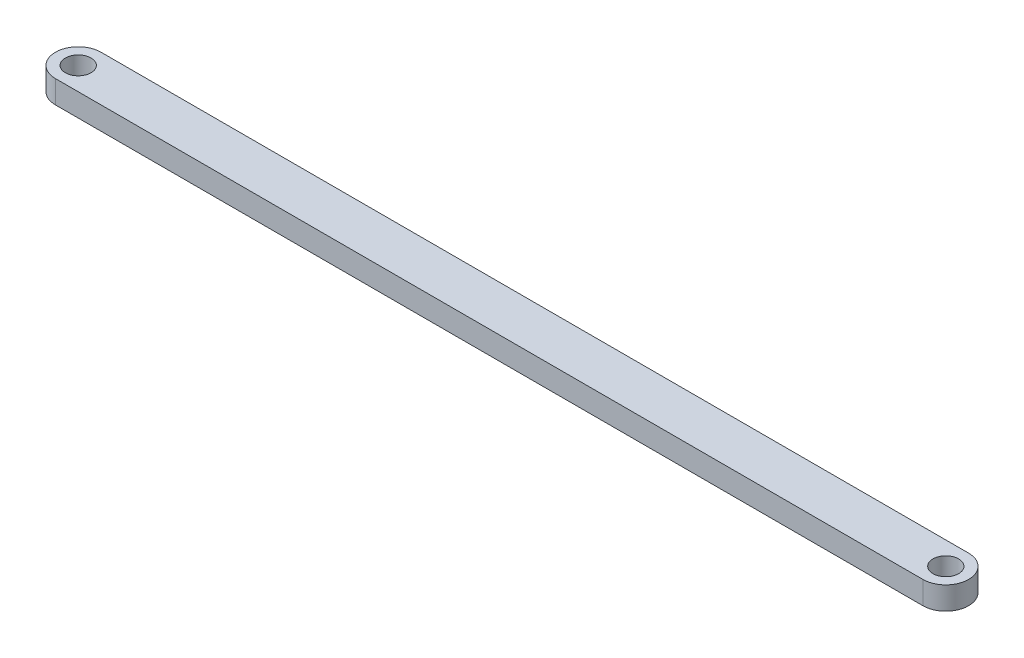
ISO-10303-21;
HEADER;
FILE_DESCRIPTION(('STEP AP214'),'2;1');
FILE_NAME('part.step','',(''),(''),'','','');
FILE_SCHEMA(('AUTOMOTIVE_DESIGN { 1 0 10303 214 1 1 1 1 }'));
ENDSEC;
DATA;
#1=APPLICATION_CONTEXT('core data for automotive mechanical design processes');
#2=APPLICATION_PROTOCOL_DEFINITION('international standard','automotive_design',2000,#1);
#3=PRODUCT_CONTEXT('',#1,'mechanical');
#4=PRODUCT('Part','Part','',(#3));
#5=PRODUCT_RELATED_PRODUCT_CATEGORY('part','',(#4));
#6=PRODUCT_DEFINITION_FORMATION('','',#4);
#7=PRODUCT_DEFINITION_CONTEXT('part definition',#1,'design');
#8=PRODUCT_DEFINITION('design','',#6,#7);
#9=PRODUCT_DEFINITION_SHAPE('','',#8);
#10=(LENGTH_UNIT() NAMED_UNIT(*) SI_UNIT(.MILLI.,.METRE.));
#11=(NAMED_UNIT(*) PLANE_ANGLE_UNIT() SI_UNIT($,.RADIAN.));
#12=(NAMED_UNIT(*) SI_UNIT($,.STERADIAN.) SOLID_ANGLE_UNIT());
#13=UNCERTAINTY_MEASURE_WITH_UNIT(LENGTH_MEASURE(1.E-05),#10,'distance_accuracy_value','');
#14=(GEOMETRIC_REPRESENTATION_CONTEXT(3) GLOBAL_UNCERTAINTY_ASSIGNED_CONTEXT((#13)) GLOBAL_UNIT_ASSIGNED_CONTEXT((#10,
#11,#12)) REPRESENTATION_CONTEXT('',''));
#15=CARTESIAN_POINT('',(0.,0.,0.));
#16=DIRECTION('',(0.,0.,1.));
#17=DIRECTION('',(1.,0.,0.));
#18=AXIS2_PLACEMENT_3D('',#15,#16,#17);
#19=CARTESIAN_POINT('',(60.366783,3.175,0.));
#20=DIRECTION('',(0.,-1.,0.));
#21=DIRECTION('',(0.,0.,-1.));
#22=AXIS2_PLACEMENT_3D('',#19,#20,#21);
#23=CYLINDRICAL_SURFACE('',#22,3.17499999999998);
#24=CARTESIAN_POINT('',(60.366783,0.,0.));
#25=DIRECTION('',(0.,1.,0.));
#26=DIRECTION('',(0.,0.,1.));
#27=AXIS2_PLACEMENT_3D('',#24,#25,#26);
#28=CIRCLE('',#27,3.17499999999998);
#29=CARTESIAN_POINT('',(60.366783,0.,3.17499999999995));
#30=VERTEX_POINT('',#29);
#31=CARTESIAN_POINT('',(60.366783,0.,-3.175));
#32=VERTEX_POINT('',#31);
#33=EDGE_CURVE('E96',#30,#32,#28,.T.);
#34=ORIENTED_EDGE('',*,*,#33,.T.);
#35=DIRECTION('',(0.,-1.,0.));
#36=VECTOR('',#35,1.);
#37=CARTESIAN_POINT('',(60.366783,3.175,-3.175));
#38=LINE('',#37,#36);
#39=CARTESIAN_POINT('',(60.366783,3.175,-3.175));
#40=VERTEX_POINT('',#39);
#41=EDGE_CURVE('E11',#40,#32,#38,.T.);
#42=ORIENTED_EDGE('',*,*,#41,.F.);
#43=CARTESIAN_POINT('',(60.366783,3.175,0.));
#44=DIRECTION('',(0.,1.,0.));
#45=DIRECTION('',(0.,0.,1.));
#46=AXIS2_PLACEMENT_3D('',#43,#44,#45);
#47=CIRCLE('',#46,3.17499999999998);
#48=CARTESIAN_POINT('',(60.366783,3.175,3.17499999999995));
#49=VERTEX_POINT('',#48);
#50=EDGE_CURVE('E84',#49,#40,#47,.T.);
#51=ORIENTED_EDGE('',*,*,#50,.F.);
#52=DIRECTION('',(0.,-1.,0.));
#53=VECTOR('',#52,1.);
#54=CARTESIAN_POINT('',(60.366783,3.175,3.17499999999995));
#55=LINE('',#54,#53);
#56=EDGE_CURVE('E92',#49,#30,#55,.T.);
#57=ORIENTED_EDGE('',*,*,#56,.T.);
#58=EDGE_LOOP('',(#34,#42,#51,#57));
#59=FACE_BOUND('',#58,.T.);
#60=ADVANCED_FACE('F33',(#59),#23,.T.);
#61=CARTESIAN_POINT('',(60.366783,3.175,-3.175));
#62=DIRECTION('',(0.,0.,1.));
#63=DIRECTION('',(1.,0.,0.));
#64=AXIS2_PLACEMENT_3D('',#61,#62,#63);
#65=PLANE('',#64);
#66=DIRECTION('',(-1.,0.,0.));
#67=VECTOR('',#66,1.);
#68=CARTESIAN_POINT('',(60.366783,0.,-3.175));
#69=LINE('',#68,#67);
#70=CARTESIAN_POINT('',(-60.366783,0.,-3.17499999999998));
#71=VERTEX_POINT('',#70);
#72=EDGE_CURVE('E88',#32,#71,#69,.T.);
#73=ORIENTED_EDGE('',*,*,#72,.T.);
#74=DIRECTION('',(0.,-1.,0.));
#75=VECTOR('',#74,1.);
#76=CARTESIAN_POINT('',(-60.366783,3.175,-3.17499999999998));
#77=LINE('',#76,#75);
#78=CARTESIAN_POINT('',(-60.366783,3.175,-3.17499999999998));
#79=VERTEX_POINT('',#78);
#80=EDGE_CURVE('E41',#79,#71,#77,.T.);
#81=ORIENTED_EDGE('',*,*,#80,.F.);
#82=DIRECTION('',(-1.,0.,0.));
#83=VECTOR('',#82,1.);
#84=CARTESIAN_POINT('',(60.366783,3.175,-3.175));
#85=LINE('',#84,#83);
#86=EDGE_CURVE('E79',#40,#79,#85,.T.);
#87=ORIENTED_EDGE('',*,*,#86,.F.);
#88=ORIENTED_EDGE('',*,*,#41,.T.);
#89=EDGE_LOOP('',(#73,#81,#87,#88));
#90=FACE_BOUND('',#89,.T.);
#91=ADVANCED_FACE('F87',(#90),#65,.F.);
#92=CARTESIAN_POINT('',(-60.366783,3.175,0.));
#93=DIRECTION('',(0.,-1.,0.));
#94=DIRECTION('',(0.,0.,-1.));
#95=AXIS2_PLACEMENT_3D('',#92,#93,#94);
#96=CYLINDRICAL_SURFACE('',#95,3.17499999999998);
#97=CARTESIAN_POINT('',(-60.366783,0.,0.));
#98=DIRECTION('',(0.,1.,0.));
#99=DIRECTION('',(0.,0.,1.));
#100=AXIS2_PLACEMENT_3D('',#97,#98,#99);
#101=CIRCLE('',#100,3.17499999999998);
#102=CARTESIAN_POINT('',(-60.366783,0.,3.17499999999999));
#103=VERTEX_POINT('',#102);
#104=EDGE_CURVE('E66',#71,#103,#101,.T.);
#105=ORIENTED_EDGE('',*,*,#104,.T.);
#106=DIRECTION('',(0.,-1.,0.));
#107=VECTOR('',#106,1.);
#108=CARTESIAN_POINT('',(-60.366783,3.175,3.17499999999999));
#109=LINE('',#108,#107);
#110=CARTESIAN_POINT('',(-60.366783,3.175,3.17499999999999));
#111=VERTEX_POINT('',#110);
#112=EDGE_CURVE('E89',#111,#103,#109,.T.);
#113=ORIENTED_EDGE('',*,*,#112,.F.);
#114=CARTESIAN_POINT('',(-60.366783,3.175,0.));
#115=DIRECTION('',(0.,1.,0.));
#116=DIRECTION('',(0.,0.,1.));
#117=AXIS2_PLACEMENT_3D('',#114,#115,#116);
#118=CIRCLE('',#117,3.17499999999998);
#119=EDGE_CURVE('E82',#79,#111,#118,.T.);
#120=ORIENTED_EDGE('',*,*,#119,.F.);
#121=ORIENTED_EDGE('',*,*,#80,.T.);
#122=EDGE_LOOP('',(#105,#113,#120,#121));
#123=FACE_BOUND('',#122,.T.);
#124=ADVANCED_FACE('F90',(#123),#96,.T.);
#125=CARTESIAN_POINT('',(60.366783,3.175,3.17499999999995));
#126=DIRECTION('',(0.,0.,-1.));
#127=DIRECTION('',(-1.,0.,0.));
#128=AXIS2_PLACEMENT_3D('',#125,#126,#127);
#129=PLANE('',#128);
#130=DIRECTION('',(1.,0.,0.));
#131=VECTOR('',#130,1.);
#132=CARTESIAN_POINT('',(60.366783,0.,3.17499999999995));
#133=LINE('',#132,#131);
#134=EDGE_CURVE('E72',#103,#30,#133,.T.);
#135=ORIENTED_EDGE('',*,*,#134,.T.);
#136=ORIENTED_EDGE('',*,*,#56,.F.);
#137=DIRECTION('',(1.,0.,0.));
#138=VECTOR('',#137,1.);
#139=CARTESIAN_POINT('',(60.366783,3.175,3.17499999999995));
#140=LINE('',#139,#138);
#141=EDGE_CURVE('E49',#111,#49,#140,.T.);
#142=ORIENTED_EDGE('',*,*,#141,.F.);
#143=ORIENTED_EDGE('',*,*,#112,.T.);
#144=EDGE_LOOP('',(#135,#136,#142,#143));
#145=FACE_BOUND('',#144,.T.);
#146=ADVANCED_FACE('F104',(#145),#129,.F.);
#147=CARTESIAN_POINT('',(60.366783,3.175,0.));
#148=DIRECTION('',(0.,1.,0.));
#149=DIRECTION('',(0.,0.,1.));
#150=AXIS2_PLACEMENT_3D('',#147,#148,#149);
#151=PLANE('',#150);
#152=CARTESIAN_POINT('',(60.366783,3.175,0.));
#153=DIRECTION('',(0.,1.,0.));
#154=DIRECTION('',(0.,0.,1.));
#155=AXIS2_PLACEMENT_3D('',#152,#153,#154);
#156=CIRCLE('',#155,1.78600099999999);
#157=CARTESIAN_POINT('',(60.366783,3.175,1.78600099999999));
#158=VERTEX_POINT('',#157);
#159=EDGE_CURVE('E118',#158,#158,#156,.T.);
#160=ORIENTED_EDGE('',*,*,#159,.F.);
#161=EDGE_LOOP('',(#160));
#162=FACE_BOUND('',#161,.T.);
#163=CARTESIAN_POINT('',(-60.366783,3.175,0.));
#164=DIRECTION('',(0.,1.,0.));
#165=DIRECTION('',(0.,0.,1.));
#166=AXIS2_PLACEMENT_3D('',#163,#164,#165);
#167=CIRCLE('',#166,1.78600099999999);
#168=CARTESIAN_POINT('',(-60.366783,3.175,1.78600099999999));
#169=VERTEX_POINT('',#168);
#170=EDGE_CURVE('E112',#169,#169,#167,.T.);
#171=ORIENTED_EDGE('',*,*,#170,.F.);
#172=EDGE_LOOP('',(#171));
#173=FACE_BOUND('',#172,.T.);
#174=ORIENTED_EDGE('',*,*,#50,.T.);
#175=ORIENTED_EDGE('',*,*,#86,.T.);
#176=ORIENTED_EDGE('',*,*,#119,.T.);
#177=ORIENTED_EDGE('',*,*,#141,.T.);
#178=EDGE_LOOP('',(#174,#175,#176,#177));
#179=FACE_BOUND('',#178,.T.);
#180=ADVANCED_FACE('F80',(#162,#173,#179),#151,.T.);
#181=CARTESIAN_POINT('',(60.366783,0.,0.));
#182=DIRECTION('',(0.,1.,0.));
#183=DIRECTION('',(0.,0.,1.));
#184=AXIS2_PLACEMENT_3D('',#181,#182,#183);
#185=PLANE('',#184);
#186=CARTESIAN_POINT('',(60.366783,0.,0.));
#187=DIRECTION('',(0.,1.,0.));
#188=DIRECTION('',(0.,0.,1.));
#189=AXIS2_PLACEMENT_3D('',#186,#187,#188);
#190=CIRCLE('',#189,1.786001);
#191=CARTESIAN_POINT('',(60.366783,0.,1.786001));
#192=VERTEX_POINT('',#191);
#193=EDGE_CURVE('E115',#192,#192,#190,.T.);
#194=ORIENTED_EDGE('',*,*,#193,.T.);
#195=EDGE_LOOP('',(#194));
#196=FACE_BOUND('',#195,.T.);
#197=CARTESIAN_POINT('',(-60.366783,0.,0.));
#198=DIRECTION('',(0.,1.,0.));
#199=DIRECTION('',(0.,0.,1.));
#200=AXIS2_PLACEMENT_3D('',#197,#198,#199);
#201=CIRCLE('',#200,1.786001);
#202=CARTESIAN_POINT('',(-60.366783,0.,1.786001));
#203=VERTEX_POINT('',#202);
#204=EDGE_CURVE('E99',#203,#203,#201,.T.);
#205=ORIENTED_EDGE('',*,*,#204,.T.);
#206=EDGE_LOOP('',(#205));
#207=FACE_BOUND('',#206,.T.);
#208=ORIENTED_EDGE('',*,*,#33,.F.);
#209=ORIENTED_EDGE('',*,*,#134,.F.);
#210=ORIENTED_EDGE('',*,*,#104,.F.);
#211=ORIENTED_EDGE('',*,*,#72,.F.);
#212=EDGE_LOOP('',(#208,#209,#210,#211));
#213=FACE_BOUND('',#212,.T.);
#214=ADVANCED_FACE('F107',(#196,#207,#213),#185,.F.);
#215=CARTESIAN_POINT('',(-60.366783,3.175,0.));
#216=DIRECTION('',(0.,1.,0.));
#217=DIRECTION('',(0.,0.,1.));
#218=AXIS2_PLACEMENT_3D('',#215,#216,#217);
#219=CYLINDRICAL_SURFACE('',#218,1.786001);
#220=ORIENTED_EDGE('',*,*,#204,.F.);
#221=EDGE_LOOP('',(#220));
#222=FACE_BOUND('',#221,.T.);
#223=ORIENTED_EDGE('',*,*,#170,.T.);
#224=EDGE_LOOP('',(#223));
#225=FACE_BOUND('',#224,.T.);
#226=ADVANCED_FACE('F129',(#222,#225),#219,.F.);
#227=CARTESIAN_POINT('',(60.366783,3.175,0.));
#228=DIRECTION('',(0.,1.,0.));
#229=DIRECTION('',(0.,0.,1.));
#230=AXIS2_PLACEMENT_3D('',#227,#228,#229);
#231=CYLINDRICAL_SURFACE('',#230,1.786001);
#232=ORIENTED_EDGE('',*,*,#193,.F.);
#233=EDGE_LOOP('',(#232));
#234=FACE_BOUND('',#233,.T.);
#235=ORIENTED_EDGE('',*,*,#159,.T.);
#236=EDGE_LOOP('',(#235));
#237=FACE_BOUND('',#236,.T.);
#238=ADVANCED_FACE('F122',(#234,#237),#231,.F.);
#239=CLOSED_SHELL('',(#60,#91,#124,#146,#180,#214,#226,#238));
#240=MANIFOLD_SOLID_BREP('B2',#239);
#241=ADVANCED_BREP_SHAPE_REPRESENTATION('',(#18,#240),#14);
#242=SHAPE_DEFINITION_REPRESENTATION(#9,#241);
ENDSEC;
END-ISO-10303-21;
